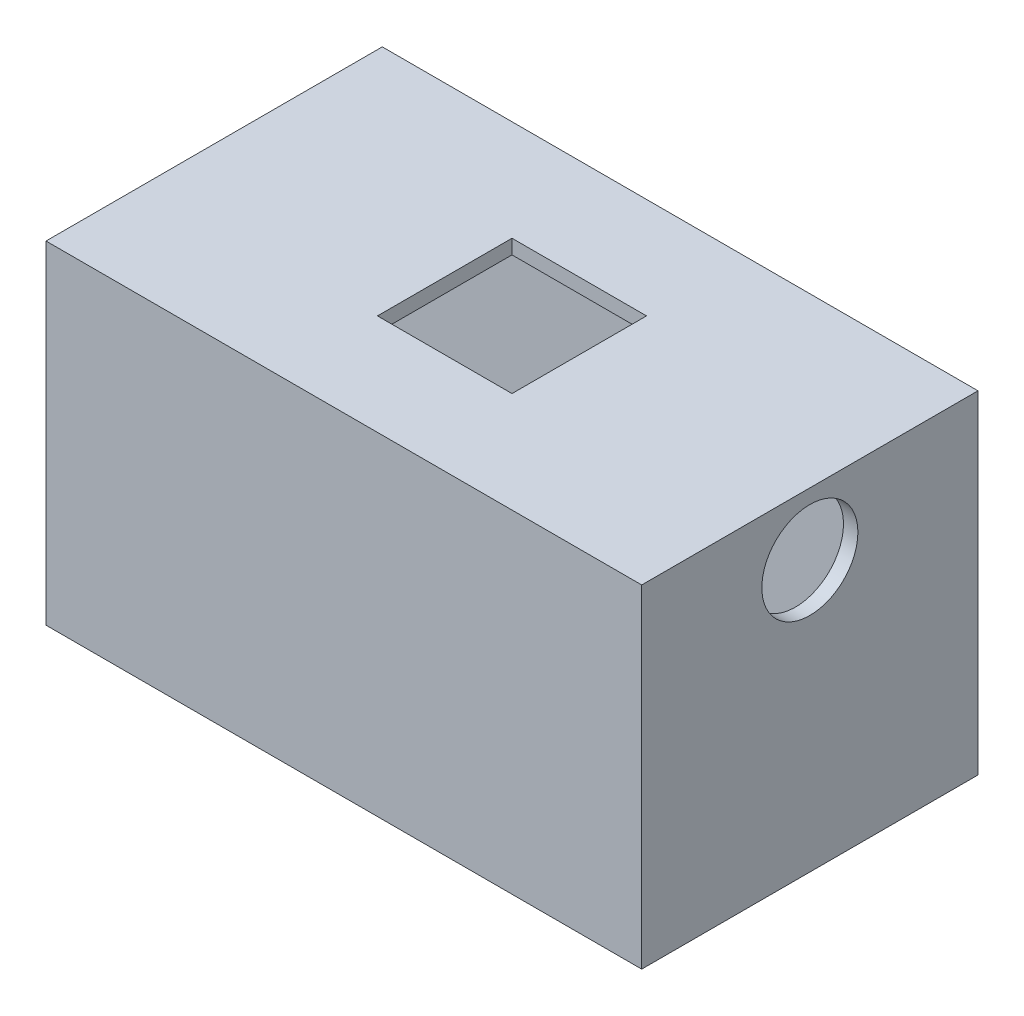
ISO-10303-21;
HEADER;
FILE_DESCRIPTION(('STEP AP214'),'2;1');
FILE_NAME('part.step','',(''),(''),'','','');
FILE_SCHEMA(('AUTOMOTIVE_DESIGN { 1 0 10303 214 1 1 1 1 }'));
ENDSEC;
DATA;
#1=APPLICATION_CONTEXT('core data for automotive mechanical design processes');
#2=APPLICATION_PROTOCOL_DEFINITION('international standard','automotive_design',2000,#1);
#3=PRODUCT_CONTEXT('',#1,'mechanical');
#4=PRODUCT('Part','Part','',(#3));
#5=PRODUCT_RELATED_PRODUCT_CATEGORY('part','',(#4));
#6=PRODUCT_DEFINITION_FORMATION('','',#4);
#7=PRODUCT_DEFINITION_CONTEXT('part definition',#1,'design');
#8=PRODUCT_DEFINITION('design','',#6,#7);
#9=PRODUCT_DEFINITION_SHAPE('','',#8);
#10=(LENGTH_UNIT() NAMED_UNIT(*) SI_UNIT(.MILLI.,.METRE.));
#11=(NAMED_UNIT(*) PLANE_ANGLE_UNIT() SI_UNIT($,.RADIAN.));
#12=(NAMED_UNIT(*) SI_UNIT($,.STERADIAN.) SOLID_ANGLE_UNIT());
#13=UNCERTAINTY_MEASURE_WITH_UNIT(LENGTH_MEASURE(1.E-05),#10,'distance_accuracy_value','');
#14=(GEOMETRIC_REPRESENTATION_CONTEXT(3) GLOBAL_UNCERTAINTY_ASSIGNED_CONTEXT((#13)) GLOBAL_UNIT_ASSIGNED_CONTEXT((#10,
#11,#12)) REPRESENTATION_CONTEXT('',''));
#15=CARTESIAN_POINT('',(0.,0.,0.));
#16=DIRECTION('',(0.,0.,1.));
#17=DIRECTION('',(1.,0.,0.));
#18=AXIS2_PLACEMENT_3D('',#15,#16,#17);
#19=CARTESIAN_POINT('',(-28.00316877496,1.5,-22.2518472906404));
#20=DIRECTION('',(1.,0.,0.));
#21=DIRECTION('',(0.,0.,-1.));
#22=AXIS2_PLACEMENT_3D('',#19,#20,#21);
#23=PLANE('',#22);
#24=DIRECTION('',(0.,-1.,0.));
#25=VECTOR('',#24,1.);
#26=CARTESIAN_POINT('',(-28.00316877496,1.5,-22.2518472906404));
#27=LINE('',#26,#25);
#28=CARTESIAN_POINT('',(-28.00316877496,4.,-22.2518472906404));
#29=VERTEX_POINT('',#28);
#30=CARTESIAN_POINT('',(-28.00316877496,-30.6291584612868,-22.2518472906404));
#31=VERTEX_POINT('',#30);
#32=EDGE_CURVE('E222',#29,#31,#27,.T.);
#33=ORIENTED_EDGE('',*,*,#32,.T.);
#34=DIRECTION('',(0.,0.,1.));
#35=VECTOR('',#34,1.);
#36=CARTESIAN_POINT('',(-28.00316877496,-30.6291584612868,-22.2518472906404));
#37=LINE('',#36,#35);
#38=CARTESIAN_POINT('',(-28.00316877496,-30.6291584612868,12.7481527093596));
#39=VERTEX_POINT('',#38);
#40=EDGE_CURVE('E219',#31,#39,#37,.T.);
#41=ORIENTED_EDGE('',*,*,#40,.T.);
#42=DIRECTION('',(0.,-1.,0.));
#43=VECTOR('',#42,1.);
#44=CARTESIAN_POINT('',(-28.00316877496,1.5,12.7481527093596));
#45=LINE('',#44,#43);
#46=CARTESIAN_POINT('',(-28.00316877496,4.,12.7481527093596));
#47=VERTEX_POINT('',#46);
#48=EDGE_CURVE('E11',#47,#39,#45,.T.);
#49=ORIENTED_EDGE('',*,*,#48,.F.);
#50=DIRECTION('',(0.,0.,1.));
#51=VECTOR('',#50,1.);
#52=CARTESIAN_POINT('',(-28.00316877496,4.,-22.2518472906404));
#53=LINE('',#52,#51);
#54=EDGE_CURVE('E176',#29,#47,#53,.T.);
#55=ORIENTED_EDGE('',*,*,#54,.F.);
#56=EDGE_LOOP('',(#33,#41,#49,#55));
#57=FACE_BOUND('',#56,.T.);
#58=ADVANCED_FACE('F35',(#57),#23,.F.);
#59=CARTESIAN_POINT('',(-28.00316877496,1.5,12.7481527093596));
#60=DIRECTION('',(0.,0.,-1.));
#61=DIRECTION('',(-1.,0.,0.));
#62=AXIS2_PLACEMENT_3D('',#59,#60,#61);
#63=PLANE('',#62);
#64=ORIENTED_EDGE('',*,*,#48,.T.);
#65=DIRECTION('',(1.,0.,0.));
#66=VECTOR('',#65,1.);
#67=CARTESIAN_POINT('',(-28.00316877496,-30.6291584612868,12.7481527093596));
#68=LINE('',#67,#66);
#69=CARTESIAN_POINT('',(33.99683122504,-30.6291584612868,12.7481527093596));
#70=VERTEX_POINT('',#69);
#71=EDGE_CURVE('E206',#39,#70,#68,.T.);
#72=ORIENTED_EDGE('',*,*,#71,.T.);
#73=DIRECTION('',(0.,-1.,0.));
#74=VECTOR('',#73,1.);
#75=CARTESIAN_POINT('',(33.99683122504,1.5,12.7481527093596));
#76=LINE('',#75,#74);
#77=CARTESIAN_POINT('',(33.99683122504,4.,12.7481527093596));
#78=VERTEX_POINT('',#77);
#79=EDGE_CURVE('E42',#78,#70,#76,.T.);
#80=ORIENTED_EDGE('',*,*,#79,.F.);
#81=DIRECTION('',(1.,0.,0.));
#82=VECTOR('',#81,1.);
#83=CARTESIAN_POINT('',(-28.00316877496,4.,12.7481527093596));
#84=LINE('',#83,#82);
#85=EDGE_CURVE('E165',#47,#78,#84,.T.);
#86=ORIENTED_EDGE('',*,*,#85,.F.);
#87=EDGE_LOOP('',(#64,#72,#80,#86));
#88=FACE_BOUND('',#87,.T.);
#89=ADVANCED_FACE('F238',(#88),#63,.F.);
#90=CARTESIAN_POINT('',(33.99683122504,1.5,-22.2518472906404));
#91=DIRECTION('',(-1.,0.,0.));
#92=DIRECTION('',(0.,0.,1.));
#93=AXIS2_PLACEMENT_3D('',#90,#91,#92);
#94=PLANE('',#93);
#95=CARTESIAN_POINT('',(33.99683122504,-2.5,-4.75184729064038));
#96=DIRECTION('',(1.,0.,0.));
#97=DIRECTION('',(0.,0.,-1.));
#98=AXIS2_PLACEMENT_3D('',#95,#96,#97);
#99=CIRCLE('',#98,5.);
#100=CARTESIAN_POINT('',(33.99683122504,-2.5,-9.75184729064038));
#101=VERTEX_POINT('',#100);
#102=EDGE_CURVE('E139',#101,#101,#99,.T.);
#103=ORIENTED_EDGE('',*,*,#102,.F.);
#104=EDGE_LOOP('',(#103));
#105=FACE_BOUND('',#104,.T.);
#106=ORIENTED_EDGE('',*,*,#79,.T.);
#107=DIRECTION('',(0.,0.,-1.));
#108=VECTOR('',#107,1.);
#109=CARTESIAN_POINT('',(33.99683122504,-30.6291584612868,12.7481527093596));
#110=LINE('',#109,#108);
#111=CARTESIAN_POINT('',(33.99683122504,-30.6291584612868,-22.2518472906404));
#112=VERTEX_POINT('',#111);
#113=EDGE_CURVE('E213',#70,#112,#110,.T.);
#114=ORIENTED_EDGE('',*,*,#113,.T.);
#115=DIRECTION('',(0.,-1.,0.));
#116=VECTOR('',#115,1.);
#117=CARTESIAN_POINT('',(33.99683122504,1.5,-22.2518472906404));
#118=LINE('',#117,#116);
#119=CARTESIAN_POINT('',(33.99683122504,4.,-22.2518472906404));
#120=VERTEX_POINT('',#119);
#121=EDGE_CURVE('E226',#120,#112,#118,.T.);
#122=ORIENTED_EDGE('',*,*,#121,.F.);
#123=DIRECTION('',(0.,0.,-1.));
#124=VECTOR('',#123,1.);
#125=CARTESIAN_POINT('',(33.99683122504,4.,12.7481527093596));
#126=LINE('',#125,#124);
#127=EDGE_CURVE('E170',#78,#120,#126,.T.);
#128=ORIENTED_EDGE('',*,*,#127,.F.);
#129=EDGE_LOOP('',(#106,#114,#122,#128));
#130=FACE_BOUND('',#129,.T.);
#131=ADVANCED_FACE('F230',(#105,#130),#94,.F.);
#132=CARTESIAN_POINT('',(-28.00316877496,1.5,-22.2518472906404));
#133=DIRECTION('',(0.,0.,1.));
#134=DIRECTION('',(1.,0.,0.));
#135=AXIS2_PLACEMENT_3D('',#132,#133,#134);
#136=PLANE('',#135);
#137=ORIENTED_EDGE('',*,*,#121,.T.);
#138=DIRECTION('',(-1.,0.,0.));
#139=VECTOR('',#138,1.);
#140=CARTESIAN_POINT('',(33.99683122504,-30.6291584612868,-22.2518472906404));
#141=LINE('',#140,#139);
#142=EDGE_CURVE('E216',#112,#31,#141,.T.);
#143=ORIENTED_EDGE('',*,*,#142,.T.);
#144=ORIENTED_EDGE('',*,*,#32,.F.);
#145=DIRECTION('',(-1.,0.,0.));
#146=VECTOR('',#145,1.);
#147=CARTESIAN_POINT('',(33.99683122504,4.,-22.2518472906404));
#148=LINE('',#147,#146);
#149=EDGE_CURVE('E173',#120,#29,#148,.T.);
#150=ORIENTED_EDGE('',*,*,#149,.F.);
#151=EDGE_LOOP('',(#137,#143,#144,#150));
#152=FACE_BOUND('',#151,.T.);
#153=ADVANCED_FACE('F245',(#152),#136,.F.);
#154=CARTESIAN_POINT('',(-0.865067631516461,-30.6291584612868,-9.28617348339576));
#155=DIRECTION('',(0.,1.,0.));
#156=DIRECTION('',(0.,0.,1.));
#157=AXIS2_PLACEMENT_3D('',#154,#155,#156);
#158=PLANE('',#157);
#159=DIRECTION('',(0.,0.,1.));
#160=VECTOR('',#159,1.);
#161=CARTESIAN_POINT('',(32.49683122504,-30.6291584612868,-20.7518472906404));
#162=LINE('',#161,#160);
#163=CARTESIAN_POINT('',(32.49683122504,-30.6291584612868,-20.7518472906404));
#164=VERTEX_POINT('',#163);
#165=CARTESIAN_POINT('',(32.4968312250401,-30.6291584612868,11.2481527093596));
#166=VERTEX_POINT('',#165);
#167=EDGE_CURVE('E194',#164,#166,#162,.T.);
#168=ORIENTED_EDGE('',*,*,#167,.F.);
#169=DIRECTION('',(1.,0.,0.));
#170=VECTOR('',#169,1.);
#171=CARTESIAN_POINT('',(-26.50316877496,-30.6291584612868,-20.7518472906404));
#172=LINE('',#171,#170);
#173=CARTESIAN_POINT('',(-26.50316877496,-30.6291584612868,-20.7518472906404));
#174=VERTEX_POINT('',#173);
#175=EDGE_CURVE('E192',#174,#164,#172,.T.);
#176=ORIENTED_EDGE('',*,*,#175,.F.);
#177=DIRECTION('',(0.,0.,-1.));
#178=VECTOR('',#177,1.);
#179=CARTESIAN_POINT('',(-26.50316877496,-30.6291584612868,11.2481527093596));
#180=LINE('',#179,#178);
#181=CARTESIAN_POINT('',(-26.50316877496,-30.6291584612868,11.2481527093596));
#182=VERTEX_POINT('',#181);
#183=EDGE_CURVE('E200',#182,#174,#180,.T.);
#184=ORIENTED_EDGE('',*,*,#183,.F.);
#185=DIRECTION('',(-1.,0.,0.));
#186=VECTOR('',#185,1.);
#187=CARTESIAN_POINT('',(32.4968312250401,-30.6291584612868,11.2481527093596));
#188=LINE('',#187,#186);
#189=EDGE_CURVE('E197',#166,#182,#188,.T.);
#190=ORIENTED_EDGE('',*,*,#189,.F.);
#191=EDGE_LOOP('',(#168,#176,#184,#190));
#192=FACE_BOUND('',#191,.T.);
#193=ORIENTED_EDGE('',*,*,#142,.F.);
#194=ORIENTED_EDGE('',*,*,#113,.F.);
#195=ORIENTED_EDGE('',*,*,#71,.F.);
#196=ORIENTED_EDGE('',*,*,#40,.F.);
#197=EDGE_LOOP('',(#193,#194,#195,#196));
#198=FACE_BOUND('',#197,.T.);
#199=ADVANCED_FACE('F236',(#192,#198),#158,.F.);
#200=CARTESIAN_POINT('',(-26.50316877496,10.3708415387132,-20.7518472906404));
#201=DIRECTION('',(0.,0.,-1.));
#202=DIRECTION('',(-1.,0.,0.));
#203=AXIS2_PLACEMENT_3D('',#200,#201,#202);
#204=PLANE('',#203);
#205=DIRECTION('',(0.,-1.,0.));
#206=VECTOR('',#205,1.);
#207=CARTESIAN_POINT('',(32.49683122504,10.3708415387132,-20.7518472906404));
#208=LINE('',#207,#206);
#209=CARTESIAN_POINT('',(32.49683122504,2.5,-20.7518472906404));
#210=VERTEX_POINT('',#209);
#211=EDGE_CURVE('E203',#210,#164,#208,.T.);
#212=ORIENTED_EDGE('',*,*,#211,.F.);
#213=DIRECTION('',(-1.,0.,0.));
#214=VECTOR('',#213,1.);
#215=CARTESIAN_POINT('',(32.49683122504,2.5,-20.7518472906404));
#216=LINE('',#215,#214);
#217=CARTESIAN_POINT('',(-26.50316877496,2.5,-20.7518472906404));
#218=VERTEX_POINT('',#217);
#219=EDGE_CURVE('E189',#210,#218,#216,.T.);
#220=ORIENTED_EDGE('',*,*,#219,.T.);
#221=DIRECTION('',(0.,-1.,0.));
#222=VECTOR('',#221,1.);
#223=CARTESIAN_POINT('',(-26.50316877496,10.3708415387132,-20.7518472906404));
#224=LINE('',#223,#222);
#225=EDGE_CURVE('E204',#218,#174,#224,.T.);
#226=ORIENTED_EDGE('',*,*,#225,.T.);
#227=ORIENTED_EDGE('',*,*,#175,.T.);
#228=EDGE_LOOP('',(#212,#220,#226,#227));
#229=FACE_BOUND('',#228,.T.);
#230=ADVANCED_FACE('F252',(#229),#204,.F.);
#231=CARTESIAN_POINT('',(-26.50316877496,10.3708415387132,11.2481527093596));
#232=DIRECTION('',(-1.,0.,0.));
#233=DIRECTION('',(0.,0.,1.));
#234=AXIS2_PLACEMENT_3D('',#231,#232,#233);
#235=PLANE('',#234);
#236=ORIENTED_EDGE('',*,*,#225,.F.);
#237=DIRECTION('',(0.,0.,1.));
#238=VECTOR('',#237,1.);
#239=CARTESIAN_POINT('',(-26.50316877496,2.5,-20.7518472906404));
#240=LINE('',#239,#238);
#241=CARTESIAN_POINT('',(-26.50316877496,2.5,11.2481527093596));
#242=VERTEX_POINT('',#241);
#243=EDGE_CURVE('E179',#218,#242,#240,.T.);
#244=ORIENTED_EDGE('',*,*,#243,.T.);
#245=DIRECTION('',(0.,-1.,0.));
#246=VECTOR('',#245,1.);
#247=CARTESIAN_POINT('',(-26.50316877496,10.3708415387132,11.2481527093596));
#248=LINE('',#247,#246);
#249=EDGE_CURVE('E207',#242,#182,#248,.T.);
#250=ORIENTED_EDGE('',*,*,#249,.T.);
#251=ORIENTED_EDGE('',*,*,#183,.T.);
#252=EDGE_LOOP('',(#236,#244,#250,#251));
#253=FACE_BOUND('',#252,.T.);
#254=ADVANCED_FACE('F354',(#253),#235,.F.);
#255=CARTESIAN_POINT('',(32.4968312250401,10.3708415387132,11.2481527093596));
#256=DIRECTION('',(0.,0.,1.));
#257=DIRECTION('',(1.,0.,0.));
#258=AXIS2_PLACEMENT_3D('',#255,#256,#257);
#259=PLANE('',#258);
#260=ORIENTED_EDGE('',*,*,#249,.F.);
#261=DIRECTION('',(1.,0.,0.));
#262=VECTOR('',#261,1.);
#263=CARTESIAN_POINT('',(-26.50316877496,2.5,11.2481527093596));
#264=LINE('',#263,#262);
#265=CARTESIAN_POINT('',(32.4968312250401,2.5,11.2481527093596));
#266=VERTEX_POINT('',#265);
#267=EDGE_CURVE('E182',#242,#266,#264,.T.);
#268=ORIENTED_EDGE('',*,*,#267,.T.);
#269=DIRECTION('',(0.,-1.,0.));
#270=VECTOR('',#269,1.);
#271=CARTESIAN_POINT('',(32.4968312250401,10.3708415387132,11.2481527093596));
#272=LINE('',#271,#270);
#273=EDGE_CURVE('E209',#266,#166,#272,.T.);
#274=ORIENTED_EDGE('',*,*,#273,.T.);
#275=ORIENTED_EDGE('',*,*,#189,.T.);
#276=EDGE_LOOP('',(#260,#268,#274,#275));
#277=FACE_BOUND('',#276,.T.);
#278=ADVANCED_FACE('F275',(#277),#259,.F.);
#279=CARTESIAN_POINT('',(32.49683122504,10.3708415387132,-20.7518472906404));
#280=DIRECTION('',(1.,0.,0.));
#281=DIRECTION('',(0.,0.,-1.));
#282=AXIS2_PLACEMENT_3D('',#279,#280,#281);
#283=PLANE('',#282);
#284=DIRECTION('',(0.,0.,-1.));
#285=VECTOR('',#284,1.);
#286=CARTESIAN_POINT('',(32.4968312250401,2.5,11.2481527093596));
#287=LINE('',#286,#285);
#288=CARTESIAN_POINT('',(32.49683122504,2.5,-4.75184729064038));
#289=VERTEX_POINT('',#288);
#290=EDGE_CURVE('E186',#266,#289,#287,.T.);
#291=ORIENTED_EDGE('',*,*,#290,.T.);
#292=CARTESIAN_POINT('',(32.49683122504,-2.5,-4.75184729064038));
#293=DIRECTION('',(1.,0.,0.));
#294=DIRECTION('',(0.,0.,-1.));
#295=AXIS2_PLACEMENT_3D('',#292,#293,#294);
#296=CIRCLE('',#295,5.);
#297=EDGE_CURVE('E162',#289,#289,#296,.T.);
#298=ORIENTED_EDGE('',*,*,#297,.T.);
#299=EDGE_CURVE('E185',#289,#210,#287,.T.);
#300=ORIENTED_EDGE('',*,*,#299,.T.);
#301=ORIENTED_EDGE('',*,*,#211,.T.);
#302=ORIENTED_EDGE('',*,*,#167,.T.);
#303=ORIENTED_EDGE('',*,*,#273,.F.);
#304=EDGE_LOOP('',(#291,#298,#300,#301,#302,#303));
#305=FACE_BOUND('',#304,.T.);
#306=ADVANCED_FACE('F280',(#305),#283,.F.);
#307=CARTESIAN_POINT('',(0.,2.5,0.));
#308=DIRECTION('',(0.,1.,0.));
#309=DIRECTION('',(0.,0.,1.));
#310=AXIS2_PLACEMENT_3D('',#307,#308,#309);
#311=PLANE('',#310);
#312=DIRECTION('',(1.,0.,0.));
#313=VECTOR('',#312,1.);
#314=CARTESIAN_POINT('',(-4.00316877495997,2.5,-11.7518472906404));
#315=LINE('',#314,#313);
#316=CARTESIAN_POINT('',(-4.00316877495997,2.5,-11.7518472906404));
#317=VERTEX_POINT('',#316);
#318=CARTESIAN_POINT('',(9.99683122504003,2.5,-11.7518472906404));
#319=VERTEX_POINT('',#318);
#320=EDGE_CURVE('E145',#317,#319,#315,.T.);
#321=ORIENTED_EDGE('',*,*,#320,.F.);
#322=DIRECTION('',(0.,0.,-1.));
#323=VECTOR('',#322,1.);
#324=CARTESIAN_POINT('',(-4.00316877495997,2.5,-11.7518472906404));
#325=LINE('',#324,#323);
#326=CARTESIAN_POINT('',(-4.00316877495997,2.5,2.24815270935962));
#327=VERTEX_POINT('',#326);
#328=EDGE_CURVE('E127',#327,#317,#325,.T.);
#329=ORIENTED_EDGE('',*,*,#328,.F.);
#330=DIRECTION('',(-1.,0.,0.));
#331=VECTOR('',#330,1.);
#332=CARTESIAN_POINT('',(-4.00316877495997,2.5,2.24815270935962));
#333=LINE('',#332,#331);
#334=CARTESIAN_POINT('',(9.99683122504003,2.5,2.24815270935962));
#335=VERTEX_POINT('',#334);
#336=EDGE_CURVE('E136',#335,#327,#333,.T.);
#337=ORIENTED_EDGE('',*,*,#336,.F.);
#338=DIRECTION('',(0.,0.,1.));
#339=VECTOR('',#338,1.);
#340=CARTESIAN_POINT('',(9.99683122504003,2.5,-11.7518472906404));
#341=LINE('',#340,#339);
#342=EDGE_CURVE('E49',#319,#335,#341,.T.);
#343=ORIENTED_EDGE('',*,*,#342,.F.);
#344=EDGE_LOOP('',(#321,#329,#337,#343));
#345=FACE_BOUND('',#344,.T.);
#346=ORIENTED_EDGE('',*,*,#267,.F.);
#347=ORIENTED_EDGE('',*,*,#243,.F.);
#348=ORIENTED_EDGE('',*,*,#219,.F.);
#349=ORIENTED_EDGE('',*,*,#299,.F.);
#350=ORIENTED_EDGE('',*,*,#290,.F.);
#351=EDGE_LOOP('',(#346,#347,#348,#349,#350));
#352=FACE_BOUND('',#351,.T.);
#353=ADVANCED_FACE('F142',(#345,#352),#311,.F.);
#354=CARTESIAN_POINT('',(0.,4.,0.));
#355=DIRECTION('',(0.,1.,0.));
#356=DIRECTION('',(0.,0.,1.));
#357=AXIS2_PLACEMENT_3D('',#354,#355,#356);
#358=PLANE('',#357);
#359=DIRECTION('',(0.,0.,1.));
#360=VECTOR('',#359,1.);
#361=CARTESIAN_POINT('',(-4.00316877495997,4.,-11.7518472906404));
#362=LINE('',#361,#360);
#363=CARTESIAN_POINT('',(-4.00316877495997,4.,-11.7518472906404));
#364=VERTEX_POINT('',#363);
#365=CARTESIAN_POINT('',(-4.00316877495997,4.,2.24815270935962));
#366=VERTEX_POINT('',#365);
#367=EDGE_CURVE('E57',#364,#366,#362,.T.);
#368=ORIENTED_EDGE('',*,*,#367,.F.);
#369=DIRECTION('',(-1.,0.,0.));
#370=VECTOR('',#369,1.);
#371=CARTESIAN_POINT('',(-4.00316877495997,4.,-11.7518472906404));
#372=LINE('',#371,#370);
#373=CARTESIAN_POINT('',(9.99683122504003,4.,-11.7518472906404));
#374=VERTEX_POINT('',#373);
#375=EDGE_CURVE('E133',#374,#364,#372,.T.);
#376=ORIENTED_EDGE('',*,*,#375,.F.);
#377=DIRECTION('',(0.,0.,-1.));
#378=VECTOR('',#377,1.);
#379=CARTESIAN_POINT('',(9.99683122504003,4.,-11.7518472906404));
#380=LINE('',#379,#378);
#381=CARTESIAN_POINT('',(9.99683122504003,4.,2.24815270935962));
#382=VERTEX_POINT('',#381);
#383=EDGE_CURVE('E153',#382,#374,#380,.T.);
#384=ORIENTED_EDGE('',*,*,#383,.F.);
#385=DIRECTION('',(1.,0.,0.));
#386=VECTOR('',#385,1.);
#387=CARTESIAN_POINT('',(-4.00316877495997,4.,2.24815270935962));
#388=LINE('',#387,#386);
#389=EDGE_CURVE('E147',#366,#382,#388,.T.);
#390=ORIENTED_EDGE('',*,*,#389,.F.);
#391=EDGE_LOOP('',(#368,#376,#384,#390));
#392=FACE_BOUND('',#391,.T.);
#393=ORIENTED_EDGE('',*,*,#85,.T.);
#394=ORIENTED_EDGE('',*,*,#127,.T.);
#395=ORIENTED_EDGE('',*,*,#149,.T.);
#396=ORIENTED_EDGE('',*,*,#54,.T.);
#397=EDGE_LOOP('',(#393,#394,#395,#396));
#398=FACE_BOUND('',#397,.T.);
#399=ADVANCED_FACE('F242',(#392,#398),#358,.T.);
#400=CARTESIAN_POINT('',(32.49683122504,-2.5,-4.75184729064038));
#401=DIRECTION('',(1.,0.,0.));
#402=DIRECTION('',(0.,0.,-1.));
#403=AXIS2_PLACEMENT_3D('',#400,#401,#402);
#404=CYLINDRICAL_SURFACE('',#403,5.);
#405=ORIENTED_EDGE('',*,*,#297,.F.);
#406=EDGE_LOOP('',(#405));
#407=FACE_BOUND('',#406,.T.);
#408=ORIENTED_EDGE('',*,*,#102,.T.);
#409=EDGE_LOOP('',(#408));
#410=FACE_BOUND('',#409,.T.);
#411=ADVANCED_FACE('F293',(#407,#410),#404,.F.);
#412=CARTESIAN_POINT('',(-4.00316877495997,-30.6301584612868,-11.7518472906404));
#413=DIRECTION('',(-1.,0.,0.));
#414=DIRECTION('',(0.,0.,1.));
#415=AXIS2_PLACEMENT_3D('',#412,#413,#414);
#416=PLANE('',#415);
#417=ORIENTED_EDGE('',*,*,#328,.T.);
#418=DIRECTION('',(0.,1.,0.));
#419=VECTOR('',#418,1.);
#420=CARTESIAN_POINT('',(-4.00316877495997,-30.6301584612868,-11.7518472906404));
#421=LINE('',#420,#419);
#422=EDGE_CURVE('E140',#317,#364,#421,.T.);
#423=ORIENTED_EDGE('',*,*,#422,.T.);
#424=ORIENTED_EDGE('',*,*,#367,.T.);
#425=DIRECTION('',(0.,1.,0.));
#426=VECTOR('',#425,1.);
#427=CARTESIAN_POINT('',(-4.00316877495997,-30.6301584612868,2.24815270935962));
#428=LINE('',#427,#426);
#429=EDGE_CURVE('E123',#327,#366,#428,.T.);
#430=ORIENTED_EDGE('',*,*,#429,.F.);
#431=EDGE_LOOP('',(#417,#423,#424,#430));
#432=FACE_BOUND('',#431,.T.);
#433=ADVANCED_FACE('F125',(#432),#416,.F.);
#434=CARTESIAN_POINT('',(-4.00316877495997,-30.6301584612868,-11.7518472906404));
#435=DIRECTION('',(0.,0.,-1.));
#436=DIRECTION('',(-1.,0.,0.));
#437=AXIS2_PLACEMENT_3D('',#434,#435,#436);
#438=PLANE('',#437);
#439=ORIENTED_EDGE('',*,*,#320,.T.);
#440=DIRECTION('',(0.,1.,0.));
#441=VECTOR('',#440,1.);
#442=CARTESIAN_POINT('',(9.99683122504003,-30.6301584612868,-11.7518472906404));
#443=LINE('',#442,#441);
#444=EDGE_CURVE('E159',#319,#374,#443,.T.);
#445=ORIENTED_EDGE('',*,*,#444,.T.);
#446=ORIENTED_EDGE('',*,*,#375,.T.);
#447=ORIENTED_EDGE('',*,*,#422,.F.);
#448=EDGE_LOOP('',(#439,#445,#446,#447));
#449=FACE_BOUND('',#448,.T.);
#450=ADVANCED_FACE('F323',(#449),#438,.F.);
#451=CARTESIAN_POINT('',(9.99683122504003,-30.6301584612868,-11.7518472906404));
#452=DIRECTION('',(1.,0.,0.));
#453=DIRECTION('',(0.,0.,-1.));
#454=AXIS2_PLACEMENT_3D('',#451,#452,#453);
#455=PLANE('',#454);
#456=ORIENTED_EDGE('',*,*,#342,.T.);
#457=DIRECTION('',(0.,1.,0.));
#458=VECTOR('',#457,1.);
#459=CARTESIAN_POINT('',(9.99683122504003,-30.6301584612868,2.24815270935962));
#460=LINE('',#459,#458);
#461=EDGE_CURVE('E132',#335,#382,#460,.T.);
#462=ORIENTED_EDGE('',*,*,#461,.T.);
#463=ORIENTED_EDGE('',*,*,#383,.T.);
#464=ORIENTED_EDGE('',*,*,#444,.F.);
#465=EDGE_LOOP('',(#456,#462,#463,#464));
#466=FACE_BOUND('',#465,.T.);
#467=ADVANCED_FACE('F332',(#466),#455,.F.);
#468=CARTESIAN_POINT('',(-4.00316877495997,-30.6301584612868,2.24815270935962));
#469=DIRECTION('',(0.,0.,1.));
#470=DIRECTION('',(1.,0.,0.));
#471=AXIS2_PLACEMENT_3D('',#468,#469,#470);
#472=PLANE('',#471);
#473=ORIENTED_EDGE('',*,*,#336,.T.);
#474=ORIENTED_EDGE('',*,*,#429,.T.);
#475=ORIENTED_EDGE('',*,*,#389,.T.);
#476=ORIENTED_EDGE('',*,*,#461,.F.);
#477=EDGE_LOOP('',(#473,#474,#475,#476));
#478=FACE_BOUND('',#477,.T.);
#479=ADVANCED_FACE('F137',(#478),#472,.F.);
#480=CLOSED_SHELL('',(#58,#89,#131,#153,#199,#230,#254,#278,#306,#353,#399,#411,#433,#450,#467,#479));
#481=MANIFOLD_SOLID_BREP('B2',#480);
#482=ADVANCED_BREP_SHAPE_REPRESENTATION('',(#18,#481),#14);
#483=SHAPE_DEFINITION_REPRESENTATION(#9,#482);
ENDSEC;
END-ISO-10303-21;
